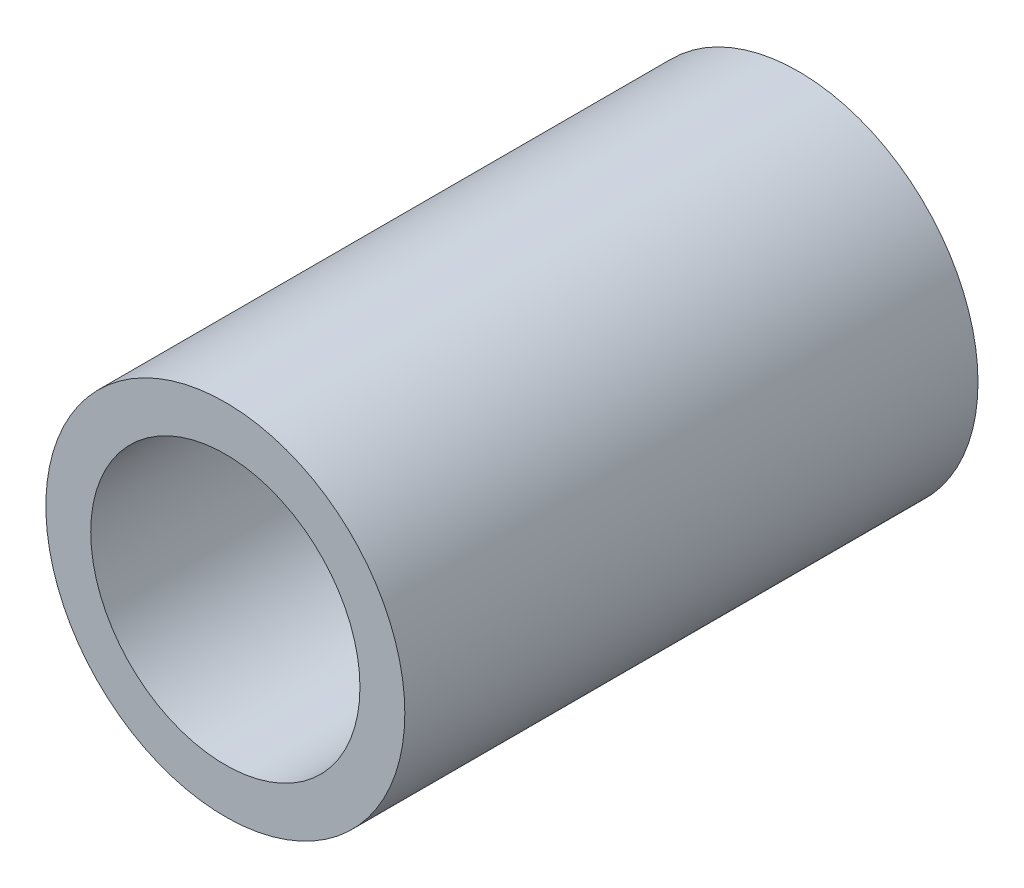
ISO-10303-21;
HEADER;
FILE_DESCRIPTION(('STEP AP214'),'2;1');
FILE_NAME('part.step','',(''),(''),'','','');
FILE_SCHEMA(('AUTOMOTIVE_DESIGN { 1 0 10303 214 1 1 1 1 }'));
ENDSEC;
DATA;
#1=APPLICATION_CONTEXT('core data for automotive mechanical design processes');
#2=APPLICATION_PROTOCOL_DEFINITION('international standard','automotive_design',2000,#1);
#3=PRODUCT_CONTEXT('',#1,'mechanical');
#4=PRODUCT('Part','Part','',(#3));
#5=PRODUCT_RELATED_PRODUCT_CATEGORY('part','',(#4));
#6=PRODUCT_DEFINITION_FORMATION('','',#4);
#7=PRODUCT_DEFINITION_CONTEXT('part definition',#1,'design');
#8=PRODUCT_DEFINITION('design','',#6,#7);
#9=PRODUCT_DEFINITION_SHAPE('','',#8);
#10=(LENGTH_UNIT() NAMED_UNIT(*) SI_UNIT(.MILLI.,.METRE.));
#11=(NAMED_UNIT(*) PLANE_ANGLE_UNIT() SI_UNIT($,.RADIAN.));
#12=(NAMED_UNIT(*) SI_UNIT($,.STERADIAN.) SOLID_ANGLE_UNIT());
#13=UNCERTAINTY_MEASURE_WITH_UNIT(LENGTH_MEASURE(1.E-05),#10,'distance_accuracy_value','');
#14=(GEOMETRIC_REPRESENTATION_CONTEXT(3) GLOBAL_UNCERTAINTY_ASSIGNED_CONTEXT((#13)) GLOBAL_UNIT_ASSIGNED_CONTEXT((#10,
#11,#12)) REPRESENTATION_CONTEXT('',''));
#15=CARTESIAN_POINT('',(0.,0.,0.));
#16=DIRECTION('',(0.,0.,1.));
#17=DIRECTION('',(1.,0.,0.));
#18=AXIS2_PLACEMENT_3D('',#15,#16,#17);
#19=CARTESIAN_POINT('',(0.,0.,60.833));
#20=DIRECTION('',(0.,0.,1.));
#21=DIRECTION('',(1.,0.,0.));
#22=AXIS2_PLACEMENT_3D('',#19,#20,#21);
#23=PLANE('',#22);
#24=CARTESIAN_POINT('',(0.,0.,60.833));
#25=DIRECTION('',(0.,0.,1.));
#26=DIRECTION('',(1.,0.,0.));
#27=AXIS2_PLACEMENT_3D('',#24,#25,#26);
#28=CIRCLE('',#27,38.1);
#29=CARTESIAN_POINT('',(38.1,0.,60.833));
#30=VERTEX_POINT('',#29);
#31=EDGE_CURVE('E10',#30,#30,#28,.T.);
#32=ORIENTED_EDGE('',*,*,#31,.T.);
#33=EDGE_LOOP('',(#32));
#34=FACE_BOUND('',#33,.T.);
#35=CARTESIAN_POINT('',(0.,0.,60.833));
#36=DIRECTION('',(0.,0.,1.));
#37=DIRECTION('',(1.,0.,0.));
#38=AXIS2_PLACEMENT_3D('',#35,#36,#37);
#39=CIRCLE('',#38,28.575);
#40=CARTESIAN_POINT('',(28.575,0.,60.833));
#41=VERTEX_POINT('',#40);
#42=EDGE_CURVE('E54',#41,#41,#39,.T.);
#43=ORIENTED_EDGE('',*,*,#42,.F.);
#44=EDGE_LOOP('',(#43));
#45=FACE_BOUND('',#44,.T.);
#46=ADVANCED_FACE('F41',(#34,#45),#23,.T.);
#47=CARTESIAN_POINT('',(0.,0.,-60.833));
#48=DIRECTION('',(0.,0.,1.));
#49=DIRECTION('',(1.,0.,0.));
#50=AXIS2_PLACEMENT_3D('',#47,#48,#49);
#51=PLANE('',#50);
#52=CARTESIAN_POINT('',(0.,0.,-60.833));
#53=DIRECTION('',(0.,0.,1.));
#54=DIRECTION('',(1.,0.,0.));
#55=AXIS2_PLACEMENT_3D('',#52,#53,#54);
#56=CIRCLE('',#55,38.1);
#57=CARTESIAN_POINT('',(38.1,0.,-60.833));
#58=VERTEX_POINT('',#57);
#59=EDGE_CURVE('E45',#58,#58,#56,.T.);
#60=ORIENTED_EDGE('',*,*,#59,.F.);
#61=EDGE_LOOP('',(#60));
#62=FACE_BOUND('',#61,.T.);
#63=CARTESIAN_POINT('',(0.,0.,-60.833));
#64=DIRECTION('',(0.,0.,1.));
#65=DIRECTION('',(1.,0.,0.));
#66=AXIS2_PLACEMENT_3D('',#63,#64,#65);
#67=CIRCLE('',#66,28.575);
#68=CARTESIAN_POINT('',(28.575,0.,-60.833));
#69=VERTEX_POINT('',#68);
#70=EDGE_CURVE('E56',#69,#69,#67,.T.);
#71=ORIENTED_EDGE('',*,*,#70,.T.);
#72=EDGE_LOOP('',(#71));
#73=FACE_BOUND('',#72,.T.);
#74=ADVANCED_FACE('F68',(#62,#73),#51,.F.);
#75=CARTESIAN_POINT('',(0.,0.,60.833));
#76=DIRECTION('',(0.,0.,-1.));
#77=DIRECTION('',(-1.,0.,0.));
#78=AXIS2_PLACEMENT_3D('',#75,#76,#77);
#79=CYLINDRICAL_SURFACE('',#78,38.1);
#80=ORIENTED_EDGE('',*,*,#31,.F.);
#81=EDGE_LOOP('',(#80));
#82=FACE_BOUND('',#81,.T.);
#83=ORIENTED_EDGE('',*,*,#59,.T.);
#84=EDGE_LOOP('',(#83));
#85=FACE_BOUND('',#84,.T.);
#86=ADVANCED_FACE('F43',(#82,#85),#79,.T.);
#87=CARTESIAN_POINT('',(0.,0.,60.833));
#88=DIRECTION('',(0.,0.,-1.));
#89=DIRECTION('',(-1.,0.,0.));
#90=AXIS2_PLACEMENT_3D('',#87,#88,#89);
#91=CYLINDRICAL_SURFACE('',#90,28.575);
#92=ORIENTED_EDGE('',*,*,#42,.T.);
#93=EDGE_LOOP('',(#92));
#94=FACE_BOUND('',#93,.T.);
#95=ORIENTED_EDGE('',*,*,#70,.F.);
#96=EDGE_LOOP('',(#95));
#97=FACE_BOUND('',#96,.T.);
#98=ADVANCED_FACE('F64',(#94,#97),#91,.F.);
#99=CLOSED_SHELL('',(#46,#74,#86,#98));
#100=MANIFOLD_SOLID_BREP('B2',#99);
#101=ADVANCED_BREP_SHAPE_REPRESENTATION('',(#18,#100),#14);
#102=SHAPE_DEFINITION_REPRESENTATION(#9,#101);
ENDSEC;
END-ISO-10303-21;
